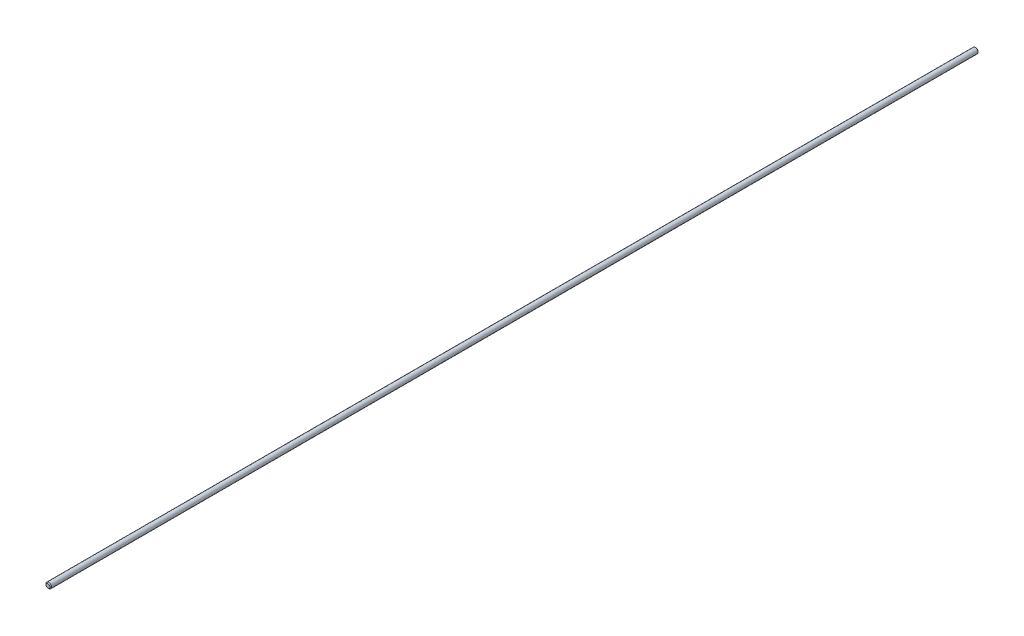
ISO-10303-21;
HEADER;
FILE_DESCRIPTION(('STEP AP214'),'2;1');
FILE_NAME('part.step','',(''),(''),'','','');
FILE_SCHEMA(('AUTOMOTIVE_DESIGN { 1 0 10303 214 1 1 1 1 }'));
ENDSEC;
DATA;
#1=APPLICATION_CONTEXT('core data for automotive mechanical design processes');
#2=APPLICATION_PROTOCOL_DEFINITION('international standard','automotive_design',2000,#1);
#3=PRODUCT_CONTEXT('',#1,'mechanical');
#4=PRODUCT('Part','Part','',(#3));
#5=PRODUCT_RELATED_PRODUCT_CATEGORY('part','',(#4));
#6=PRODUCT_DEFINITION_FORMATION('','',#4);
#7=PRODUCT_DEFINITION_CONTEXT('part definition',#1,'design');
#8=PRODUCT_DEFINITION('design','',#6,#7);
#9=PRODUCT_DEFINITION_SHAPE('','',#8);
#10=(LENGTH_UNIT() NAMED_UNIT(*) SI_UNIT(.MILLI.,.METRE.));
#11=(NAMED_UNIT(*) PLANE_ANGLE_UNIT() SI_UNIT($,.RADIAN.));
#12=(NAMED_UNIT(*) SI_UNIT($,.STERADIAN.) SOLID_ANGLE_UNIT());
#13=UNCERTAINTY_MEASURE_WITH_UNIT(LENGTH_MEASURE(1.E-05),#10,'distance_accuracy_value','');
#14=(GEOMETRIC_REPRESENTATION_CONTEXT(3) GLOBAL_UNCERTAINTY_ASSIGNED_CONTEXT((#13)) GLOBAL_UNIT_ASSIGNED_CONTEXT((#10,
#11,#12)) REPRESENTATION_CONTEXT('',''));
#15=CARTESIAN_POINT('',(0.,0.,0.));
#16=DIRECTION('',(0.,0.,1.));
#17=DIRECTION('',(1.,0.,0.));
#18=AXIS2_PLACEMENT_3D('',#15,#16,#17);
#19=CARTESIAN_POINT('',(0.,0.,266.065));
#20=DIRECTION('',(0.,0.,1.));
#21=DIRECTION('',(1.,0.,0.));
#22=AXIS2_PLACEMENT_3D('',#19,#20,#21);
#23=CYLINDRICAL_SURFACE('',#22,1.58750000000174);
#24=CARTESIAN_POINT('',(0.,0.,-265.58875));
#25=DIRECTION('',(0.,0.,1.));
#26=DIRECTION('',(1.,0.,0.));
#27=AXIS2_PLACEMENT_3D('',#24,#25,#26);
#28=CIRCLE('',#27,1.58750000000174);
#29=CARTESIAN_POINT('',(1.58750000000174,0.,-265.58875));
#30=VERTEX_POINT('',#29);
#31=EDGE_CURVE('E42',#30,#30,#28,.T.);
#32=ORIENTED_EDGE('',*,*,#31,.T.);
#33=EDGE_LOOP('',(#32));
#34=FACE_BOUND('',#33,.T.);
#35=CARTESIAN_POINT('',(0.,0.,265.58875));
#36=DIRECTION('',(0.,0.,-1.));
#37=DIRECTION('',(-1.,0.,0.));
#38=AXIS2_PLACEMENT_3D('',#35,#36,#37);
#39=CIRCLE('',#38,1.58750000000174);
#40=CARTESIAN_POINT('',(-1.58750000000174,0.,265.58875));
#41=VERTEX_POINT('',#40);
#42=EDGE_CURVE('E46',#41,#41,#39,.T.);
#43=ORIENTED_EDGE('',*,*,#42,.T.);
#44=EDGE_LOOP('',(#43));
#45=FACE_BOUND('',#44,.T.);
#46=ADVANCED_FACE('F31',(#34,#45),#23,.T.);
#47=CARTESIAN_POINT('',(0.,1.58750000000174,-266.065));
#48=DIRECTION('',(0.,0.,1.));
#49=DIRECTION('',(1.,0.,0.));
#50=AXIS2_PLACEMENT_3D('',#47,#48,#49);
#51=PLANE('',#50);
#52=CARTESIAN_POINT('',(0.,0.,-266.065));
#53=DIRECTION('',(0.,0.,1.));
#54=DIRECTION('',(1.,0.,0.));
#55=AXIS2_PLACEMENT_3D('',#52,#53,#54);
#56=CIRCLE('',#55,1.11125000000178);
#57=CARTESIAN_POINT('',(1.11125000000178,0.,-266.065));
#58=VERTEX_POINT('',#57);
#59=EDGE_CURVE('E38',#58,#58,#56,.F.);
#60=ORIENTED_EDGE('',*,*,#59,.T.);
#61=EDGE_LOOP('',(#60));
#62=FACE_BOUND('',#61,.T.);
#63=ADVANCED_FACE('F62',(#62),#51,.F.);
#64=CARTESIAN_POINT('',(0.,0.,266.065));
#65=DIRECTION('',(0.,0.,-1.));
#66=DIRECTION('',(-1.,0.,0.));
#67=AXIS2_PLACEMENT_3D('',#64,#65,#66);
#68=PLANE('',#67);
#69=CARTESIAN_POINT('',(0.,0.,266.065));
#70=DIRECTION('',(0.,0.,-1.));
#71=DIRECTION('',(-1.,0.,0.));
#72=AXIS2_PLACEMENT_3D('',#69,#70,#71);
#73=CIRCLE('',#72,1.11125000000184);
#74=CARTESIAN_POINT('',(-1.11125000000184,0.,266.065));
#75=VERTEX_POINT('',#74);
#76=EDGE_CURVE('E10',#75,#75,#73,.F.);
#77=ORIENTED_EDGE('',*,*,#76,.T.);
#78=EDGE_LOOP('',(#77));
#79=FACE_BOUND('',#78,.T.);
#80=ADVANCED_FACE('F59',(#79),#68,.F.);
#81=CARTESIAN_POINT('',(0.,0.,-265.58875));
#82=DIRECTION('',(0.,0.,1.));
#83=DIRECTION('',(1.,0.,0.));
#84=AXIS2_PLACEMENT_3D('',#81,#82,#83);
#85=CONICAL_SURFACE('',#84,1.58750000000174,0.785398163397451);
#86=ORIENTED_EDGE('',*,*,#59,.F.);
#87=EDGE_LOOP('',(#86));
#88=FACE_BOUND('',#87,.T.);
#89=ORIENTED_EDGE('',*,*,#31,.F.);
#90=EDGE_LOOP('',(#89));
#91=FACE_BOUND('',#90,.T.);
#92=ADVANCED_FACE('F55',(#88,#91),#85,.T.);
#93=CARTESIAN_POINT('',(0.,0.,266.065));
#94=DIRECTION('',(0.,0.,-1.));
#95=DIRECTION('',(-1.,0.,0.));
#96=AXIS2_PLACEMENT_3D('',#93,#94,#95);
#97=CONICAL_SURFACE('',#96,1.11125000000184,0.785398163397451);
#98=ORIENTED_EDGE('',*,*,#42,.F.);
#99=EDGE_LOOP('',(#98));
#100=FACE_BOUND('',#99,.T.);
#101=ORIENTED_EDGE('',*,*,#76,.F.);
#102=EDGE_LOOP('',(#101));
#103=FACE_BOUND('',#102,.T.);
#104=ADVANCED_FACE('F33',(#100,#103),#97,.T.);
#105=CLOSED_SHELL('',(#46,#63,#80,#92,#104));
#106=MANIFOLD_SOLID_BREP('B2',#105);
#107=ADVANCED_BREP_SHAPE_REPRESENTATION('',(#18,#106),#14);
#108=SHAPE_DEFINITION_REPRESENTATION(#9,#107);
ENDSEC;
END-ISO-10303-21;
